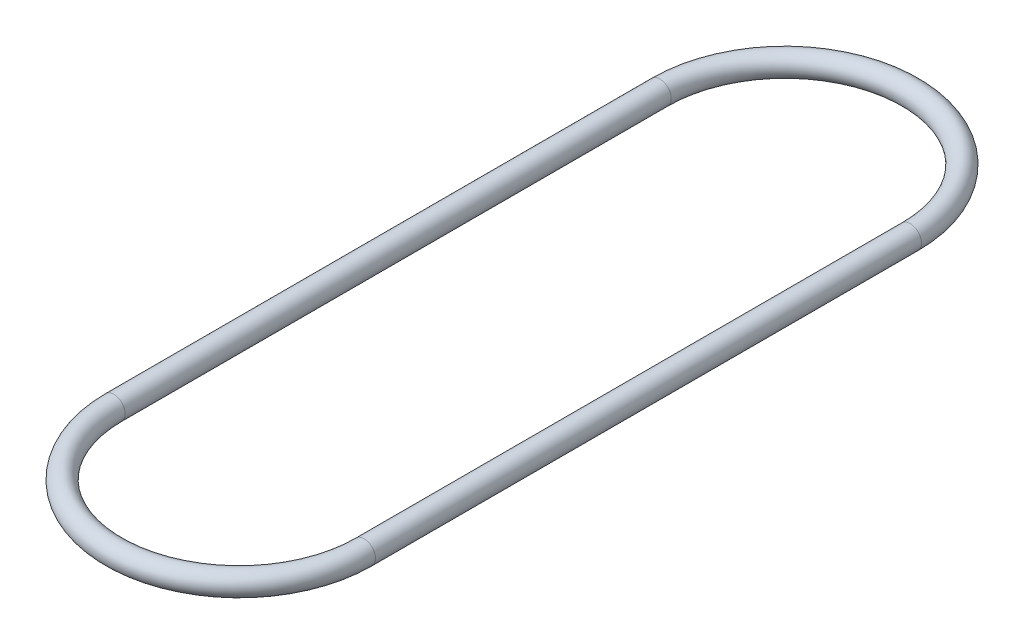
ISO-10303-21;
HEADER;
FILE_DESCRIPTION(('STEP AP214'),'2;1');
FILE_NAME('part.step','',(''),(''),'','','');
FILE_SCHEMA(('AUTOMOTIVE_DESIGN { 1 0 10303 214 1 1 1 1 }'));
ENDSEC;
DATA;
#1=APPLICATION_CONTEXT('core data for automotive mechanical design processes');
#2=APPLICATION_PROTOCOL_DEFINITION('international standard','automotive_design',2000,#1);
#3=PRODUCT_CONTEXT('',#1,'mechanical');
#4=PRODUCT('Part','Part','',(#3));
#5=PRODUCT_RELATED_PRODUCT_CATEGORY('part','',(#4));
#6=PRODUCT_DEFINITION_FORMATION('','',#4);
#7=PRODUCT_DEFINITION_CONTEXT('part definition',#1,'design');
#8=PRODUCT_DEFINITION('design','',#6,#7);
#9=PRODUCT_DEFINITION_SHAPE('','',#8);
#10=(LENGTH_UNIT() NAMED_UNIT(*) SI_UNIT(.MILLI.,.METRE.));
#11=(NAMED_UNIT(*) PLANE_ANGLE_UNIT() SI_UNIT($,.RADIAN.));
#12=(NAMED_UNIT(*) SI_UNIT($,.STERADIAN.) SOLID_ANGLE_UNIT());
#13=UNCERTAINTY_MEASURE_WITH_UNIT(LENGTH_MEASURE(1.E-05),#10,'distance_accuracy_value','');
#14=(GEOMETRIC_REPRESENTATION_CONTEXT(3) GLOBAL_UNCERTAINTY_ASSIGNED_CONTEXT((#13)) GLOBAL_UNIT_ASSIGNED_CONTEXT((#10,
#11,#12)) REPRESENTATION_CONTEXT('',''));
#15=CARTESIAN_POINT('',(0.,0.,0.));
#16=DIRECTION('',(0.,0.,1.));
#17=DIRECTION('',(1.,0.,0.));
#18=AXIS2_PLACEMENT_3D('',#15,#16,#17);
#19=CARTESIAN_POINT('',(0.,0.,-152.4));
#20=DIRECTION('',(0.,0.,1.));
#21=DIRECTION('',(1.,0.,0.));
#22=AXIS2_PLACEMENT_3D('',#19,#20,#21);
#23=CYLINDRICAL_SURFACE('',#22,3.175);
#24=CARTESIAN_POINT('',(0.,0.,0.));
#25=DIRECTION('',(0.,0.,1.));
#26=DIRECTION('',(1.,0.,0.));
#27=AXIS2_PLACEMENT_3D('',#24,#25,#26);
#28=CIRCLE('',#27,3.175);
#29=CARTESIAN_POINT('',(-3.175,0.,0.));
#30=VERTEX_POINT('',#29);
#31=EDGE_CURVE('E44',#30,#30,#28,.T.);
#32=ORIENTED_EDGE('',*,*,#31,.F.);
#33=EDGE_LOOP('',(#32));
#34=FACE_BOUND('',#33,.T.);
#35=CARTESIAN_POINT('',(0.,0.,-152.4));
#36=DIRECTION('',(0.,0.,1.));
#37=DIRECTION('',(1.,0.,0.));
#38=AXIS2_PLACEMENT_3D('',#35,#36,#37);
#39=CIRCLE('',#38,3.175);
#40=CARTESIAN_POINT('',(-3.175,0.,-152.4));
#41=VERTEX_POINT('',#40);
#42=EDGE_CURVE('E10',#41,#41,#39,.T.);
#43=ORIENTED_EDGE('',*,*,#42,.T.);
#44=EDGE_LOOP('',(#43));
#45=FACE_BOUND('',#44,.T.);
#46=ADVANCED_FACE('F30',(#34,#45),#23,.T.);
#47=CARTESIAN_POINT('',(34.925,0.,-152.4));
#48=DIRECTION('',(0.,1.,0.));
#49=DIRECTION('',(0.,0.,1.));
#50=AXIS2_PLACEMENT_3D('',#47,#48,#49);
#51=TOROIDAL_SURFACE('',#50,34.925,3.175);
#52=CARTESIAN_POINT('',(69.85,0.,-152.4));
#53=DIRECTION('',(0.,0.,-1.));
#54=DIRECTION('',(-1.,0.,0.));
#55=AXIS2_PLACEMENT_3D('',#52,#53,#54);
#56=CIRCLE('',#55,3.175);
#57=CARTESIAN_POINT('',(73.025,0.,-152.4));
#58=VERTEX_POINT('',#57);
#59=EDGE_CURVE('E36',#58,#58,#56,.T.);
#60=CARTESIAN_POINT('',(34.925,0.,-152.4));
#61=DIRECTION('',(0.,1.,0.));
#62=DIRECTION('',(0.,0.,1.));
#63=AXIS2_PLACEMENT_3D('',#60,#61,#62);
#64=CIRCLE('',#63,38.1);
#65=EDGE_CURVE('',#58,#41,#64,.T.);
#66=ORIENTED_EDGE('',*,*,#59,.T.);
#67=ORIENTED_EDGE('',*,*,#42,.F.);
#68=ORIENTED_EDGE('',*,*,#65,.T.);
#69=ORIENTED_EDGE('',*,*,#65,.F.);
#70=EDGE_LOOP('',(#66,#68,#67,#69));
#71=FACE_BOUND('',#70,.T.);
#72=ADVANCED_FACE('F53',(#71),#51,.T.);
#73=CARTESIAN_POINT('',(69.85,0.,0.));
#74=DIRECTION('',(0.,0.,-1.));
#75=DIRECTION('',(-1.,0.,0.));
#76=AXIS2_PLACEMENT_3D('',#73,#74,#75);
#77=CYLINDRICAL_SURFACE('',#76,3.175);
#78=ORIENTED_EDGE('',*,*,#59,.F.);
#79=EDGE_LOOP('',(#78));
#80=FACE_BOUND('',#79,.T.);
#81=CARTESIAN_POINT('',(69.85,0.,0.));
#82=DIRECTION('',(0.,0.,-1.));
#83=DIRECTION('',(-1.,0.,0.));
#84=AXIS2_PLACEMENT_3D('',#81,#82,#83);
#85=CIRCLE('',#84,3.175);
#86=CARTESIAN_POINT('',(73.025,0.,0.));
#87=VERTEX_POINT('',#86);
#88=EDGE_CURVE('E40',#87,#87,#85,.T.);
#89=ORIENTED_EDGE('',*,*,#88,.T.);
#90=EDGE_LOOP('',(#89));
#91=FACE_BOUND('',#90,.T.);
#92=ADVANCED_FACE('F57',(#80,#91),#77,.T.);
#93=CARTESIAN_POINT('',(34.925,0.,0.));
#94=DIRECTION('',(0.,1.,0.));
#95=DIRECTION('',(0.,0.,1.));
#96=AXIS2_PLACEMENT_3D('',#93,#94,#95);
#97=TOROIDAL_SURFACE('',#96,34.925,3.175);
#98=CARTESIAN_POINT('',(34.925,0.,0.));
#99=DIRECTION('',(0.,1.,0.));
#100=DIRECTION('',(0.,0.,1.));
#101=AXIS2_PLACEMENT_3D('',#98,#99,#100);
#102=CIRCLE('',#101,38.1);
#103=EDGE_CURVE('',#30,#87,#102,.T.);
#104=ORIENTED_EDGE('',*,*,#31,.T.);
#105=ORIENTED_EDGE('',*,*,#88,.F.);
#106=ORIENTED_EDGE('',*,*,#103,.T.);
#107=ORIENTED_EDGE('',*,*,#103,.F.);
#108=EDGE_LOOP('',(#104,#106,#105,#107));
#109=FACE_BOUND('',#108,.T.);
#110=ADVANCED_FACE('F50',(#109),#97,.T.);
#111=CLOSED_SHELL('',(#46,#72,#92,#110));
#112=MANIFOLD_SOLID_BREP('B2',#111);
#113=ADVANCED_BREP_SHAPE_REPRESENTATION('',(#18,#112),#14);
#114=SHAPE_DEFINITION_REPRESENTATION(#9,#113);
ENDSEC;
END-ISO-10303-21;
